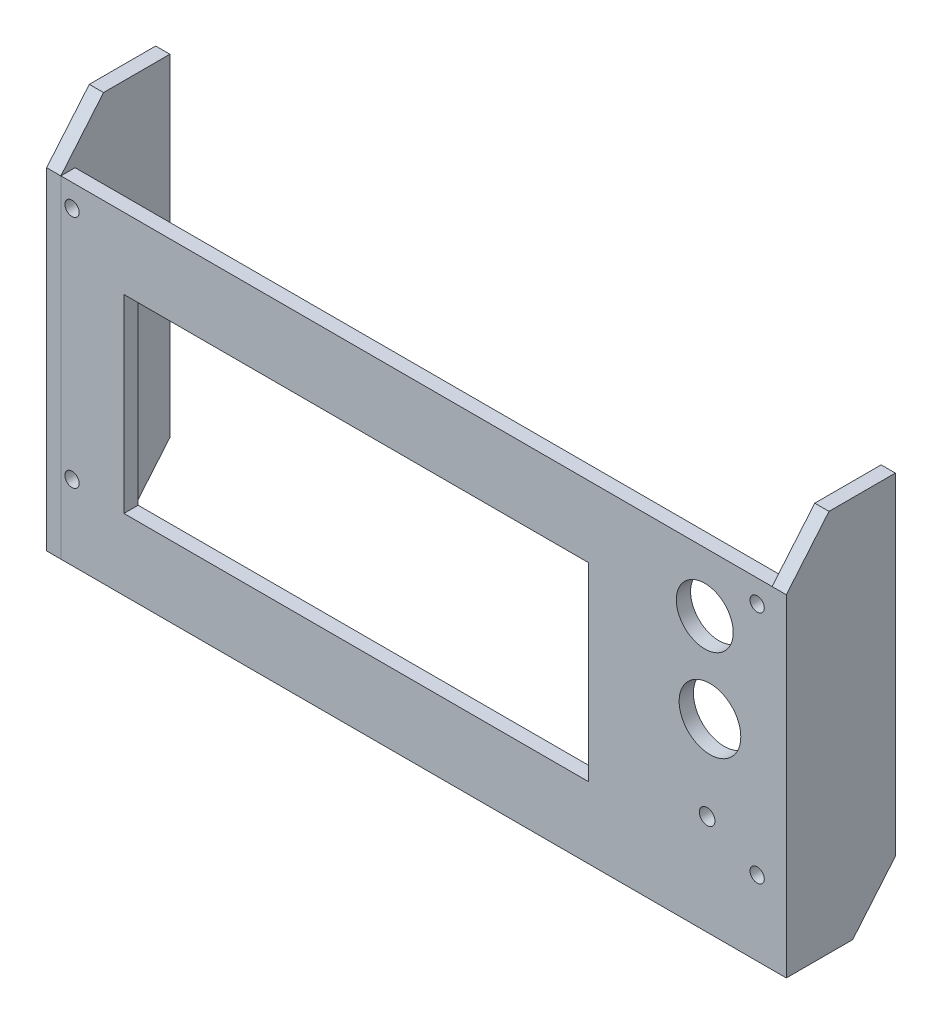
ISO-10303-21;
HEADER;
FILE_DESCRIPTION(('STEP AP214'),'2;1');
FILE_NAME('part.step','',(''),(''),'','','');
FILE_SCHEMA(('AUTOMOTIVE_DESIGN { 1 0 10303 214 1 1 1 1 }'));
ENDSEC;
DATA;
#1=APPLICATION_CONTEXT('core data for automotive mechanical design processes');
#2=APPLICATION_PROTOCOL_DEFINITION('international standard','automotive_design',2000,#1);
#3=PRODUCT_CONTEXT('',#1,'mechanical');
#4=PRODUCT('Part','Part','',(#3));
#5=PRODUCT_RELATED_PRODUCT_CATEGORY('part','',(#4));
#6=PRODUCT_DEFINITION_FORMATION('','',#4);
#7=PRODUCT_DEFINITION_CONTEXT('part definition',#1,'design');
#8=PRODUCT_DEFINITION('design','',#6,#7);
#9=PRODUCT_DEFINITION_SHAPE('','',#8);
#10=(LENGTH_UNIT() NAMED_UNIT(*) SI_UNIT(.MILLI.,.METRE.));
#11=(NAMED_UNIT(*) PLANE_ANGLE_UNIT() SI_UNIT($,.RADIAN.));
#12=(NAMED_UNIT(*) SI_UNIT($,.STERADIAN.) SOLID_ANGLE_UNIT());
#13=UNCERTAINTY_MEASURE_WITH_UNIT(LENGTH_MEASURE(1.E-05),#10,'distance_accuracy_value','');
#14=(GEOMETRIC_REPRESENTATION_CONTEXT(3) GLOBAL_UNCERTAINTY_ASSIGNED_CONTEXT((#13)) GLOBAL_UNIT_ASSIGNED_CONTEXT((#10,
#11,#12)) REPRESENTATION_CONTEXT('',''));
#15=CARTESIAN_POINT('',(0.,0.,0.));
#16=DIRECTION('',(0.,0.,1.));
#17=DIRECTION('',(1.,0.,0.));
#18=AXIS2_PLACEMENT_3D('',#15,#16,#17);
#19=CARTESIAN_POINT('',(-3.,0.,0.));
#20=DIRECTION('',(0.,-1.,0.));
#21=DIRECTION('',(0.,0.,-1.));
#22=AXIS2_PLACEMENT_3D('',#19,#20,#21);
#23=PLANE('',#22);
#24=DIRECTION('',(0.,0.,-1.));
#25=VECTOR('',#24,1.);
#26=CARTESIAN_POINT('',(0.,0.,0.));
#27=LINE('',#26,#25);
#28=CARTESIAN_POINT('',(0.,0.,3.));
#29=VERTEX_POINT('',#28);
#30=CARTESIAN_POINT('',(0.,0.,-11.));
#31=VERTEX_POINT('',#30);
#32=EDGE_CURVE('E125',#29,#31,#27,.T.);
#33=ORIENTED_EDGE('',*,*,#32,.F.);
#34=DIRECTION('',(1.,0.,0.));
#35=VECTOR('',#34,1.);
#36=CARTESIAN_POINT('',(-3.,0.,3.));
#37=LINE('',#36,#35);
#38=CARTESIAN_POINT('',(-3.,0.,3.));
#39=VERTEX_POINT('',#38);
#40=EDGE_CURVE('E12',#39,#29,#37,.T.);
#41=ORIENTED_EDGE('',*,*,#40,.F.);
#42=DIRECTION('',(0.,0.,-1.));
#43=VECTOR('',#42,1.);
#44=CARTESIAN_POINT('',(-3.,0.,0.));
#45=LINE('',#44,#43);
#46=CARTESIAN_POINT('',(-3.,0.,-11.));
#47=VERTEX_POINT('',#46);
#48=EDGE_CURVE('E139',#39,#47,#45,.T.);
#49=ORIENTED_EDGE('',*,*,#48,.T.);
#50=DIRECTION('',(1.,0.,0.));
#51=VECTOR('',#50,1.);
#52=CARTESIAN_POINT('',(-3.,0.,-11.));
#53=LINE('',#52,#51);
#54=EDGE_CURVE('E60',#47,#31,#53,.T.);
#55=ORIENTED_EDGE('',*,*,#54,.T.);
#56=EDGE_LOOP('',(#33,#41,#49,#55));
#57=FACE_BOUND('',#56,.T.);
#58=ADVANCED_FACE('F44',(#57),#23,.T.);
#59=CARTESIAN_POINT('',(-3.,0.,3.));
#60=DIRECTION('',(0.,0.,-1.));
#61=DIRECTION('',(-1.,0.,0.));
#62=AXIS2_PLACEMENT_3D('',#59,#60,#61);
#63=PLANE('',#62);
#64=DIRECTION('',(0.,1.,0.));
#65=VECTOR('',#64,1.);
#66=CARTESIAN_POINT('',(0.,0.,3.));
#67=LINE('',#66,#65);
#68=CARTESIAN_POINT('',(0.,70.,3.));
#69=VERTEX_POINT('',#68);
#70=EDGE_CURVE('E127',#29,#69,#67,.T.);
#71=ORIENTED_EDGE('',*,*,#70,.T.);
#72=DIRECTION('',(1.,0.,0.));
#73=VECTOR('',#72,1.);
#74=CARTESIAN_POINT('',(-3.,70.,3.));
#75=LINE('',#74,#73);
#76=CARTESIAN_POINT('',(-3.,70.,3.));
#77=VERTEX_POINT('',#76);
#78=EDGE_CURVE('E52',#77,#69,#75,.T.);
#79=ORIENTED_EDGE('',*,*,#78,.F.);
#80=DIRECTION('',(0.,1.,0.));
#81=VECTOR('',#80,1.);
#82=CARTESIAN_POINT('',(-3.,0.,3.));
#83=LINE('',#82,#81);
#84=EDGE_CURVE('E226',#39,#77,#83,.T.);
#85=ORIENTED_EDGE('',*,*,#84,.F.);
#86=ORIENTED_EDGE('',*,*,#40,.T.);
#87=EDGE_LOOP('',(#71,#79,#85,#86));
#88=FACE_BOUND('',#87,.T.);
#89=ADVANCED_FACE('F148',(#88),#63,.F.);
#90=CARTESIAN_POINT('',(-3.,30.3995254111756,36.2287436219277));
#91=DIRECTION('',(0.,0.642787609686538,0.766044443118979));
#92=DIRECTION('',(0.,-0.766044443118979,0.642787609686538));
#93=AXIS2_PLACEMENT_3D('',#90,#91,#92);
#94=PLANE('',#93);
#95=DIRECTION('',(0.,-0.76604444311898,0.642787609686538));
#96=VECTOR('',#95,1.);
#97=CARTESIAN_POINT('',(0.,30.3995254111756,36.2287436219277));
#98=LINE('',#97,#96);
#99=CARTESIAN_POINT('',(0.,80.7257823333479,-6.));
#100=VERTEX_POINT('',#99);
#101=EDGE_CURVE('E130',#100,#69,#98,.T.);
#102=ORIENTED_EDGE('',*,*,#101,.F.);
#103=DIRECTION('',(1.,0.,0.));
#104=VECTOR('',#103,1.);
#105=CARTESIAN_POINT('',(-3.,80.7257823333479,-6.));
#106=LINE('',#105,#104);
#107=CARTESIAN_POINT('',(-3.,80.7257823333479,-6.));
#108=VERTEX_POINT('',#107);
#109=EDGE_CURVE('E107',#108,#100,#106,.T.);
#110=ORIENTED_EDGE('',*,*,#109,.F.);
#111=DIRECTION('',(0.,-0.76604444311898,0.642787609686538));
#112=VECTOR('',#111,1.);
#113=CARTESIAN_POINT('',(-3.,30.3995254111756,36.2287436219277));
#114=LINE('',#113,#112);
#115=EDGE_CURVE('E117',#108,#77,#114,.T.);
#116=ORIENTED_EDGE('',*,*,#115,.T.);
#117=ORIENTED_EDGE('',*,*,#78,.T.);
#118=EDGE_LOOP('',(#102,#110,#116,#117));
#119=FACE_BOUND('',#118,.T.);
#120=ADVANCED_FACE('F145',(#119),#94,.T.);
#121=CARTESIAN_POINT('',(-3.,80.7257823333479,0.));
#122=DIRECTION('',(0.,1.,0.));
#123=DIRECTION('',(0.,0.,1.));
#124=AXIS2_PLACEMENT_3D('',#121,#122,#123);
#125=PLANE('',#124);
#126=DIRECTION('',(0.,0.,1.));
#127=VECTOR('',#126,1.);
#128=CARTESIAN_POINT('',(0.,80.7257823333479,0.));
#129=LINE('',#128,#127);
#130=CARTESIAN_POINT('',(0.,80.7257823333479,-20.));
#131=VERTEX_POINT('',#130);
#132=EDGE_CURVE('E103',#131,#100,#129,.T.);
#133=ORIENTED_EDGE('',*,*,#132,.F.);
#134=DIRECTION('',(1.,0.,0.));
#135=VECTOR('',#134,1.);
#136=CARTESIAN_POINT('',(-3.,80.7257823333479,-20.));
#137=LINE('',#136,#135);
#138=CARTESIAN_POINT('',(-3.,80.7257823333479,-20.));
#139=VERTEX_POINT('',#138);
#140=EDGE_CURVE('E98',#139,#131,#137,.T.);
#141=ORIENTED_EDGE('',*,*,#140,.F.);
#142=DIRECTION('',(0.,0.,1.));
#143=VECTOR('',#142,1.);
#144=CARTESIAN_POINT('',(-3.,80.7257823333479,0.));
#145=LINE('',#144,#143);
#146=EDGE_CURVE('E101',#139,#108,#145,.T.);
#147=ORIENTED_EDGE('',*,*,#146,.T.);
#148=ORIENTED_EDGE('',*,*,#109,.T.);
#149=EDGE_LOOP('',(#133,#141,#147,#148));
#150=FACE_BOUND('',#149,.T.);
#151=ADVANCED_FACE('F100',(#150),#125,.T.);
#152=CARTESIAN_POINT('',(-3.,0.,-20.));
#153=DIRECTION('',(0.,0.,-1.));
#154=DIRECTION('',(0.,1.,0.));
#155=AXIS2_PLACEMENT_3D('',#152,#153,#154);
#156=PLANE('',#155);
#157=DIRECTION('',(0.,1.,0.));
#158=VECTOR('',#157,1.);
#159=CARTESIAN_POINT('',(0.,0.,-20.));
#160=LINE('',#159,#158);
#161=CARTESIAN_POINT('',(0.,10.7257823333479,-20.));
#162=VERTEX_POINT('',#161);
#163=EDGE_CURVE('E134',#162,#131,#160,.T.);
#164=ORIENTED_EDGE('',*,*,#163,.F.);
#165=DIRECTION('',(1.,0.,0.));
#166=VECTOR('',#165,1.);
#167=CARTESIAN_POINT('',(-3.,10.7257823333479,-20.));
#168=LINE('',#167,#166);
#169=CARTESIAN_POINT('',(-3.,10.7257823333479,-20.));
#170=VERTEX_POINT('',#169);
#171=EDGE_CURVE('E79',#170,#162,#168,.T.);
#172=ORIENTED_EDGE('',*,*,#171,.F.);
#173=DIRECTION('',(0.,1.,0.));
#174=VECTOR('',#173,1.);
#175=CARTESIAN_POINT('',(-3.,0.,-20.));
#176=LINE('',#175,#174);
#177=EDGE_CURVE('E115',#170,#139,#176,.T.);
#178=ORIENTED_EDGE('',*,*,#177,.T.);
#179=ORIENTED_EDGE('',*,*,#140,.T.);
#180=EDGE_LOOP('',(#164,#172,#178,#179));
#181=FACE_BOUND('',#180,.T.);
#182=ADVANCED_FACE('F119',(#181),#156,.T.);
#183=CARTESIAN_POINT('',(-3.,-5.41644264156714,-6.45506497716814));
#184=DIRECTION('',(0.,-0.642787609686538,-0.76604444311898));
#185=DIRECTION('',(0.,0.76604444311898,-0.642787609686538));
#186=AXIS2_PLACEMENT_3D('',#183,#184,#185);
#187=PLANE('',#186);
#188=DIRECTION('',(0.,0.766044443118979,-0.642787609686538));
#189=VECTOR('',#188,1.);
#190=CARTESIAN_POINT('',(0.,-5.41644264156714,-6.45506497716814));
#191=LINE('',#190,#189);
#192=EDGE_CURVE('E136',#31,#162,#191,.T.);
#193=ORIENTED_EDGE('',*,*,#192,.F.);
#194=ORIENTED_EDGE('',*,*,#54,.F.);
#195=DIRECTION('',(0.,0.766044443118979,-0.642787609686538));
#196=VECTOR('',#195,1.);
#197=CARTESIAN_POINT('',(-3.,-5.41644264156714,-6.45506497716814));
#198=LINE('',#197,#196);
#199=EDGE_CURVE('E120',#47,#170,#198,.T.);
#200=ORIENTED_EDGE('',*,*,#199,.T.);
#201=ORIENTED_EDGE('',*,*,#171,.T.);
#202=EDGE_LOOP('',(#193,#194,#200,#201));
#203=FACE_BOUND('',#202,.T.);
#204=ADVANCED_FACE('F151',(#203),#187,.T.);
#205=CARTESIAN_POINT('',(-3.,0.,0.));
#206=DIRECTION('',(-1.,0.,0.));
#207=DIRECTION('',(0.,0.,1.));
#208=AXIS2_PLACEMENT_3D('',#205,#206,#207);
#209=PLANE('',#208);
#210=ORIENTED_EDGE('',*,*,#48,.F.);
#211=ORIENTED_EDGE('',*,*,#84,.T.);
#212=ORIENTED_EDGE('',*,*,#115,.F.);
#213=ORIENTED_EDGE('',*,*,#146,.F.);
#214=ORIENTED_EDGE('',*,*,#177,.F.);
#215=ORIENTED_EDGE('',*,*,#199,.F.);
#216=EDGE_LOOP('',(#210,#211,#212,#213,#214,#215));
#217=FACE_BOUND('',#216,.T.);
#218=ADVANCED_FACE('F113',(#217),#209,.T.);
#219=CARTESIAN_POINT('',(0.,0.,0.));
#220=DIRECTION('',(-1.,0.,0.));
#221=DIRECTION('',(0.,0.,1.));
#222=AXIS2_PLACEMENT_3D('',#219,#220,#221);
#223=PLANE('',#222);
#224=ORIENTED_EDGE('',*,*,#32,.T.);
#225=ORIENTED_EDGE('',*,*,#192,.T.);
#226=ORIENTED_EDGE('',*,*,#163,.T.);
#227=ORIENTED_EDGE('',*,*,#132,.T.);
#228=ORIENTED_EDGE('',*,*,#101,.T.);
#229=ORIENTED_EDGE('',*,*,#70,.F.);
#230=EDGE_LOOP('',(#224,#225,#226,#227,#228,#229));
#231=FACE_BOUND('',#230,.T.);
#232=ADVANCED_FACE('F150',(#231),#223,.F.);
#233=CLOSED_SHELL('',(#58,#89,#120,#151,#182,#204,#218,#232));
#234=MANIFOLD_SOLID_BREP('B2',#233);
#235=CARTESIAN_POINT('',(0.,0.,3.));
#236=DIRECTION('',(0.,0.,-1.));
#237=DIRECTION('',(-1.,0.,0.));
#238=AXIS2_PLACEMENT_3D('',#235,#236,#237);
#239=PLANE('',#238);
#240=CARTESIAN_POINT('',(146.85,15.75,3.));
#241=DIRECTION('',(0.,0.,1.));
#242=DIRECTION('',(1.,0.,0.));
#243=AXIS2_PLACEMENT_3D('',#240,#241,#242);
#244=CIRCLE('',#243,1.5);
#245=CARTESIAN_POINT('',(148.35,15.75,3.));
#246=VERTEX_POINT('',#245);
#247=EDGE_CURVE('E386',#246,#246,#244,.T.);
#248=ORIENTED_EDGE('',*,*,#247,.F.);
#249=EDGE_LOOP('',(#248));
#250=FACE_BOUND('',#249,.T.);
#251=CARTESIAN_POINT('',(2.35,15.75,3.));
#252=DIRECTION('',(0.,0.,1.));
#253=DIRECTION('',(1.,0.,0.));
#254=AXIS2_PLACEMENT_3D('',#251,#252,#253);
#255=CIRCLE('',#254,1.5);
#256=CARTESIAN_POINT('',(3.85000000000001,15.75,3.));
#257=VERTEX_POINT('',#256);
#258=EDGE_CURVE('E392',#257,#257,#255,.T.);
#259=ORIENTED_EDGE('',*,*,#258,.F.);
#260=EDGE_LOOP('',(#259));
#261=FACE_BOUND('',#260,.T.);
#262=CARTESIAN_POINT('',(2.35,65.25,3.));
#263=DIRECTION('',(0.,0.,1.));
#264=DIRECTION('',(1.,0.,0.));
#265=AXIS2_PLACEMENT_3D('',#262,#263,#264);
#266=CIRCLE('',#265,1.5);
#267=CARTESIAN_POINT('',(3.85000000000001,65.25,3.));
#268=VERTEX_POINT('',#267);
#269=EDGE_CURVE('E381',#268,#268,#266,.T.);
#270=ORIENTED_EDGE('',*,*,#269,.F.);
#271=EDGE_LOOP('',(#270));
#272=FACE_BOUND('',#271,.T.);
#273=CARTESIAN_POINT('',(146.85,65.25,3.));
#274=DIRECTION('',(0.,0.,1.));
#275=DIRECTION('',(1.,0.,0.));
#276=AXIS2_PLACEMENT_3D('',#273,#274,#275);
#277=CIRCLE('',#276,1.5);
#278=CARTESIAN_POINT('',(148.35,65.25,3.));
#279=VERTEX_POINT('',#278);
#280=EDGE_CURVE('E385',#279,#279,#277,.T.);
#281=ORIENTED_EDGE('',*,*,#280,.F.);
#282=EDGE_LOOP('',(#281));
#283=FACE_BOUND('',#282,.T.);
#284=CARTESIAN_POINT('',(136.3,21.15,3.));
#285=DIRECTION('',(0.,0.,1.));
#286=DIRECTION('',(1.,0.,0.));
#287=AXIS2_PLACEMENT_3D('',#284,#285,#286);
#288=CIRCLE('',#287,1.65000000000002);
#289=CARTESIAN_POINT('',(137.95,21.15,3.));
#290=VERTEX_POINT('',#289);
#291=EDGE_CURVE('E403',#290,#290,#288,.T.);
#292=ORIENTED_EDGE('',*,*,#291,.F.);
#293=EDGE_LOOP('',(#292));
#294=FACE_BOUND('',#293,.T.);
#295=CARTESIAN_POINT('',(136.9,39.25,3.));
#296=DIRECTION('',(0.,0.,1.));
#297=DIRECTION('',(1.,0.,0.));
#298=AXIS2_PLACEMENT_3D('',#295,#296,#297);
#299=CIRCLE('',#298,6.50000000000002);
#300=CARTESIAN_POINT('',(143.4,39.25,3.));
#301=VERTEX_POINT('',#300);
#302=EDGE_CURVE('E409',#301,#301,#299,.T.);
#303=ORIENTED_EDGE('',*,*,#302,.F.);
#304=EDGE_LOOP('',(#303));
#305=FACE_BOUND('',#304,.T.);
#306=DIRECTION('',(0.,1.,0.));
#307=VECTOR('',#306,1.);
#308=CARTESIAN_POINT('',(111.3,55.,3.));
#309=LINE('',#308,#307);
#310=CARTESIAN_POINT('',(111.3,15.,3.));
#311=VERTEX_POINT('',#310);
#312=CARTESIAN_POINT('',(111.3,55.,3.));
#313=VERTEX_POINT('',#312);
#314=EDGE_CURVE('E430',#311,#313,#309,.T.);
#315=ORIENTED_EDGE('',*,*,#314,.F.);
#316=DIRECTION('',(1.,0.,0.));
#317=VECTOR('',#316,1.);
#318=CARTESIAN_POINT('',(111.3,15.,3.));
#319=LINE('',#318,#317);
#320=CARTESIAN_POINT('',(13.3,15.,3.));
#321=VERTEX_POINT('',#320);
#322=EDGE_CURVE('E246',#321,#311,#319,.T.);
#323=ORIENTED_EDGE('',*,*,#322,.F.);
#324=DIRECTION('',(0.,-1.,0.));
#325=VECTOR('',#324,1.);
#326=CARTESIAN_POINT('',(13.3,15.,3.));
#327=LINE('',#326,#325);
#328=CARTESIAN_POINT('',(13.3,55.,3.));
#329=VERTEX_POINT('',#328);
#330=EDGE_CURVE('E421',#329,#321,#327,.T.);
#331=ORIENTED_EDGE('',*,*,#330,.F.);
#332=DIRECTION('',(-1.,0.,0.));
#333=VECTOR('',#332,1.);
#334=CARTESIAN_POINT('',(13.3,55.,3.));
#335=LINE('',#334,#333);
#336=EDGE_CURVE('E433',#313,#329,#335,.T.);
#337=ORIENTED_EDGE('',*,*,#336,.F.);
#338=EDGE_LOOP('',(#315,#323,#331,#337));
#339=FACE_BOUND('',#338,.T.);
#340=DIRECTION('',(1.,0.,0.));
#341=VECTOR('',#340,1.);
#342=CARTESIAN_POINT('',(150.,0.,3.));
#343=LINE('',#342,#341);
#344=CARTESIAN_POINT('',(0.,0.,3.));
#345=VERTEX_POINT('',#344);
#346=CARTESIAN_POINT('',(153.,0.,3.));
#347=VERTEX_POINT('',#346);
#348=EDGE_CURVE('E323',#345,#347,#343,.T.);
#349=ORIENTED_EDGE('',*,*,#348,.T.);
#350=DIRECTION('',(0.,-1.,0.));
#351=VECTOR('',#350,1.);
#352=CARTESIAN_POINT('',(153.,70.,3.));
#353=LINE('',#352,#351);
#354=CARTESIAN_POINT('',(153.,70.,3.));
#355=VERTEX_POINT('',#354);
#356=EDGE_CURVE('E328',#355,#347,#353,.T.);
#357=ORIENTED_EDGE('',*,*,#356,.F.);
#358=DIRECTION('',(-1.,0.,0.));
#359=VECTOR('',#358,1.);
#360=CARTESIAN_POINT('',(153.,70.,3.));
#361=LINE('',#360,#359);
#362=CARTESIAN_POINT('',(150.,70.,3.));
#363=VERTEX_POINT('',#362);
#364=EDGE_CURVE('E362',#355,#363,#361,.T.);
#365=ORIENTED_EDGE('',*,*,#364,.T.);
#366=DIRECTION('',(-1.,0.,0.));
#367=VECTOR('',#366,1.);
#368=CARTESIAN_POINT('',(0.,70.,3.));
#369=LINE('',#368,#367);
#370=CARTESIAN_POINT('',(0.,70.,3.));
#371=VERTEX_POINT('',#370);
#372=EDGE_CURVE('E334',#363,#371,#369,.T.);
#373=ORIENTED_EDGE('',*,*,#372,.T.);
#374=DIRECTION('',(0.,-1.,0.));
#375=VECTOR('',#374,1.);
#376=CARTESIAN_POINT('',(0.,0.,3.));
#377=LINE('',#376,#375);
#378=EDGE_CURVE('E330',#371,#345,#377,.T.);
#379=ORIENTED_EDGE('',*,*,#378,.T.);
#380=EDGE_LOOP('',(#349,#357,#365,#373,#379));
#381=FACE_BOUND('',#380,.T.);
#382=CARTESIAN_POINT('',(135.8,57.5,3.));
#383=DIRECTION('',(0.,0.,1.));
#384=DIRECTION('',(1.,0.,0.));
#385=AXIS2_PLACEMENT_3D('',#382,#383,#384);
#386=CIRCLE('',#385,6.00000000000002);
#387=CARTESIAN_POINT('',(141.8,57.5,3.));
#388=VERTEX_POINT('',#387);
#389=EDGE_CURVE('E446',#388,#388,#386,.T.);
#390=ORIENTED_EDGE('',*,*,#389,.F.);
#391=EDGE_LOOP('',(#390));
#392=FACE_BOUND('',#391,.T.);
#393=ADVANCED_FACE('F231',(#250,#261,#272,#283,#294,#305,#339,#381,#392),#239,.F.);
#394=CARTESIAN_POINT('',(0.,0.,0.));
#395=DIRECTION('',(0.,0.,-1.));
#396=DIRECTION('',(-1.,0.,0.));
#397=AXIS2_PLACEMENT_3D('',#394,#395,#396);
#398=PLANE('',#397);
#399=CARTESIAN_POINT('',(146.85,15.75,0.));
#400=DIRECTION('',(0.,0.,1.));
#401=DIRECTION('',(1.,0.,0.));
#402=AXIS2_PLACEMENT_3D('',#399,#400,#401);
#403=CIRCLE('',#402,1.5);
#404=CARTESIAN_POINT('',(148.35,15.75,0.));
#405=VERTEX_POINT('',#404);
#406=EDGE_CURVE('E382',#405,#405,#403,.T.);
#407=ORIENTED_EDGE('',*,*,#406,.T.);
#408=EDGE_LOOP('',(#407));
#409=FACE_BOUND('',#408,.T.);
#410=CARTESIAN_POINT('',(2.35,15.75,0.));
#411=DIRECTION('',(0.,0.,1.));
#412=DIRECTION('',(1.,0.,0.));
#413=AXIS2_PLACEMENT_3D('',#410,#411,#412);
#414=CIRCLE('',#413,1.5);
#415=CARTESIAN_POINT('',(3.85000000000001,15.75,0.));
#416=VERTEX_POINT('',#415);
#417=EDGE_CURVE('E389',#416,#416,#414,.T.);
#418=ORIENTED_EDGE('',*,*,#417,.T.);
#419=EDGE_LOOP('',(#418));
#420=FACE_BOUND('',#419,.T.);
#421=CARTESIAN_POINT('',(2.35,65.25,0.));
#422=DIRECTION('',(0.,0.,1.));
#423=DIRECTION('',(1.,0.,0.));
#424=AXIS2_PLACEMENT_3D('',#421,#422,#423);
#425=CIRCLE('',#424,1.5);
#426=CARTESIAN_POINT('',(3.85000000000001,65.25,0.));
#427=VERTEX_POINT('',#426);
#428=EDGE_CURVE('E395',#427,#427,#425,.T.);
#429=ORIENTED_EDGE('',*,*,#428,.T.);
#430=EDGE_LOOP('',(#429));
#431=FACE_BOUND('',#430,.T.);
#432=CARTESIAN_POINT('',(146.85,65.25,0.));
#433=DIRECTION('',(0.,0.,1.));
#434=DIRECTION('',(1.,0.,0.));
#435=AXIS2_PLACEMENT_3D('',#432,#433,#434);
#436=CIRCLE('',#435,1.5);
#437=CARTESIAN_POINT('',(148.35,65.25,0.));
#438=VERTEX_POINT('',#437);
#439=EDGE_CURVE('E400',#438,#438,#436,.T.);
#440=ORIENTED_EDGE('',*,*,#439,.T.);
#441=EDGE_LOOP('',(#440));
#442=FACE_BOUND('',#441,.T.);
#443=CARTESIAN_POINT('',(136.3,21.15,0.));
#444=DIRECTION('',(0.,0.,1.));
#445=DIRECTION('',(1.,0.,0.));
#446=AXIS2_PLACEMENT_3D('',#443,#444,#445);
#447=CIRCLE('',#446,1.65000000000002);
#448=CARTESIAN_POINT('',(137.95,21.15,0.));
#449=VERTEX_POINT('',#448);
#450=EDGE_CURVE('E406',#449,#449,#447,.T.);
#451=ORIENTED_EDGE('',*,*,#450,.T.);
#452=EDGE_LOOP('',(#451));
#453=FACE_BOUND('',#452,.T.);
#454=CARTESIAN_POINT('',(136.9,39.25,0.));
#455=DIRECTION('',(0.,0.,1.));
#456=DIRECTION('',(1.,0.,0.));
#457=AXIS2_PLACEMENT_3D('',#454,#455,#456);
#458=CIRCLE('',#457,6.50000000000002);
#459=CARTESIAN_POINT('',(143.4,39.25,0.));
#460=VERTEX_POINT('',#459);
#461=EDGE_CURVE('E412',#460,#460,#458,.T.);
#462=ORIENTED_EDGE('',*,*,#461,.T.);
#463=EDGE_LOOP('',(#462));
#464=FACE_BOUND('',#463,.T.);
#465=DIRECTION('',(1.,0.,0.));
#466=VECTOR('',#465,1.);
#467=CARTESIAN_POINT('',(111.3,15.,0.));
#468=LINE('',#467,#466);
#469=CARTESIAN_POINT('',(13.3,15.,0.));
#470=VERTEX_POINT('',#469);
#471=CARTESIAN_POINT('',(111.3,15.,0.));
#472=VERTEX_POINT('',#471);
#473=EDGE_CURVE('E417',#470,#472,#468,.T.);
#474=ORIENTED_EDGE('',*,*,#473,.T.);
#475=DIRECTION('',(0.,1.,0.));
#476=VECTOR('',#475,1.);
#477=CARTESIAN_POINT('',(111.3,55.,0.));
#478=LINE('',#477,#476);
#479=CARTESIAN_POINT('',(111.3,55.,0.));
#480=VERTEX_POINT('',#479);
#481=EDGE_CURVE('E420',#472,#480,#478,.T.);
#482=ORIENTED_EDGE('',*,*,#481,.T.);
#483=DIRECTION('',(-1.,0.,0.));
#484=VECTOR('',#483,1.);
#485=CARTESIAN_POINT('',(13.3,55.,0.));
#486=LINE('',#485,#484);
#487=CARTESIAN_POINT('',(13.3,55.,0.));
#488=VERTEX_POINT('',#487);
#489=EDGE_CURVE('E254',#480,#488,#486,.T.);
#490=ORIENTED_EDGE('',*,*,#489,.T.);
#491=DIRECTION('',(0.,-1.,0.));
#492=VECTOR('',#491,1.);
#493=CARTESIAN_POINT('',(13.3,15.,0.));
#494=LINE('',#493,#492);
#495=EDGE_CURVE('E425',#488,#470,#494,.T.);
#496=ORIENTED_EDGE('',*,*,#495,.T.);
#497=EDGE_LOOP('',(#474,#482,#490,#496));
#498=FACE_BOUND('',#497,.T.);
#499=DIRECTION('',(1.,0.,0.));
#500=VECTOR('',#499,1.);
#501=CARTESIAN_POINT('',(150.,0.,0.));
#502=LINE('',#501,#500);
#503=CARTESIAN_POINT('',(0.,0.,0.));
#504=VERTEX_POINT('',#503);
#505=CARTESIAN_POINT('',(150.,0.,0.));
#506=VERTEX_POINT('',#505);
#507=EDGE_CURVE('E449',#504,#506,#502,.T.);
#508=ORIENTED_EDGE('',*,*,#507,.F.);
#509=DIRECTION('',(0.,-1.,0.));
#510=VECTOR('',#509,1.);
#511=CARTESIAN_POINT('',(0.,0.,0.));
#512=LINE('',#511,#510);
#513=CARTESIAN_POINT('',(0.,70.,0.));
#514=VERTEX_POINT('',#513);
#515=EDGE_CURVE('E335',#514,#504,#512,.T.);
#516=ORIENTED_EDGE('',*,*,#515,.F.);
#517=DIRECTION('',(-1.,0.,0.));
#518=VECTOR('',#517,1.);
#519=CARTESIAN_POINT('',(0.,70.,0.));
#520=LINE('',#519,#518);
#521=CARTESIAN_POINT('',(150.,70.,0.));
#522=VERTEX_POINT('',#521);
#523=EDGE_CURVE('E458',#522,#514,#520,.T.);
#524=ORIENTED_EDGE('',*,*,#523,.F.);
#525=DIRECTION('',(0.,1.,0.));
#526=VECTOR('',#525,1.);
#527=CARTESIAN_POINT('',(150.,70.,0.));
#528=LINE('',#527,#526);
#529=EDGE_CURVE('E456',#506,#522,#528,.T.);
#530=ORIENTED_EDGE('',*,*,#529,.F.);
#531=EDGE_LOOP('',(#508,#516,#524,#530));
#532=FACE_BOUND('',#531,.T.);
#533=CARTESIAN_POINT('',(135.8,57.5,0.));
#534=DIRECTION('',(0.,0.,1.));
#535=DIRECTION('',(1.,0.,0.));
#536=AXIS2_PLACEMENT_3D('',#533,#534,#535);
#537=CIRCLE('',#536,6.00000000000002);
#538=CARTESIAN_POINT('',(141.8,57.5,0.));
#539=VERTEX_POINT('',#538);
#540=EDGE_CURVE('E440',#539,#539,#537,.T.);
#541=ORIENTED_EDGE('',*,*,#540,.T.);
#542=EDGE_LOOP('',(#541));
#543=FACE_BOUND('',#542,.T.);
#544=ADVANCED_FACE('F471',(#409,#420,#431,#442,#453,#464,#498,#532,#543),#398,.T.);
#545=CARTESIAN_POINT('',(150.,0.,3.));
#546=DIRECTION('',(0.,1.,0.));
#547=DIRECTION('',(-1.,0.,0.));
#548=AXIS2_PLACEMENT_3D('',#545,#546,#547);
#549=PLANE('',#548);
#550=ORIENTED_EDGE('',*,*,#507,.T.);
#551=DIRECTION('',(0.,0.,-1.));
#552=VECTOR('',#551,1.);
#553=CARTESIAN_POINT('',(150.,0.,-11.));
#554=LINE('',#553,#552);
#555=CARTESIAN_POINT('',(150.,0.,-11.));
#556=VERTEX_POINT('',#555);
#557=EDGE_CURVE('E363',#506,#556,#554,.T.);
#558=ORIENTED_EDGE('',*,*,#557,.T.);
#559=DIRECTION('',(-1.,0.,0.));
#560=VECTOR('',#559,1.);
#561=CARTESIAN_POINT('',(153.,0.,-11.));
#562=LINE('',#561,#560);
#563=CARTESIAN_POINT('',(153.,0.,-11.));
#564=VERTEX_POINT('',#563);
#565=EDGE_CURVE('E341',#564,#556,#562,.T.);
#566=ORIENTED_EDGE('',*,*,#565,.F.);
#567=DIRECTION('',(0.,0.,-1.));
#568=VECTOR('',#567,1.);
#569=CARTESIAN_POINT('',(153.,0.,-11.));
#570=LINE('',#569,#568);
#571=EDGE_CURVE('E338',#347,#564,#570,.T.);
#572=ORIENTED_EDGE('',*,*,#571,.F.);
#573=ORIENTED_EDGE('',*,*,#348,.F.);
#574=DIRECTION('',(0.,0.,-1.));
#575=VECTOR('',#574,1.);
#576=CARTESIAN_POINT('',(0.,0.,3.));
#577=LINE('',#576,#575);
#578=EDGE_CURVE('E454',#345,#504,#577,.T.);
#579=ORIENTED_EDGE('',*,*,#578,.T.);
#580=EDGE_LOOP('',(#550,#558,#566,#572,#573,#579));
#581=FACE_BOUND('',#580,.T.);
#582=ADVANCED_FACE('F233',(#581),#549,.F.);
#583=CARTESIAN_POINT('',(0.,70.,3.));
#584=DIRECTION('',(0.,-1.,0.));
#585=DIRECTION('',(0.,0.,-1.));
#586=AXIS2_PLACEMENT_3D('',#583,#584,#585);
#587=PLANE('',#586);
#588=ORIENTED_EDGE('',*,*,#523,.T.);
#589=DIRECTION('',(0.,0.,-1.));
#590=VECTOR('',#589,1.);
#591=CARTESIAN_POINT('',(0.,70.,3.));
#592=LINE('',#591,#590);
#593=EDGE_CURVE('E239',#371,#514,#592,.T.);
#594=ORIENTED_EDGE('',*,*,#593,.F.);
#595=ORIENTED_EDGE('',*,*,#372,.F.);
#596=DIRECTION('',(0.,0.,-1.));
#597=VECTOR('',#596,1.);
#598=CARTESIAN_POINT('',(150.,70.,3.));
#599=LINE('',#598,#597);
#600=EDGE_CURVE('E42',#363,#522,#599,.T.);
#601=ORIENTED_EDGE('',*,*,#600,.T.);
#602=EDGE_LOOP('',(#588,#594,#595,#601));
#603=FACE_BOUND('',#602,.T.);
#604=ADVANCED_FACE('F493',(#603),#587,.F.);
#605=CARTESIAN_POINT('',(0.,0.,3.));
#606=DIRECTION('',(1.,0.,0.));
#607=DIRECTION('',(0.,0.,-1.));
#608=AXIS2_PLACEMENT_3D('',#605,#606,#607);
#609=PLANE('',#608);
#610=ORIENTED_EDGE('',*,*,#515,.T.);
#611=ORIENTED_EDGE('',*,*,#578,.F.);
#612=ORIENTED_EDGE('',*,*,#378,.F.);
#613=ORIENTED_EDGE('',*,*,#593,.T.);
#614=EDGE_LOOP('',(#610,#611,#612,#613));
#615=FACE_BOUND('',#614,.T.);
#616=ADVANCED_FACE('F465',(#615),#609,.F.);
#617=CARTESIAN_POINT('',(135.8,57.5,3.));
#618=DIRECTION('',(0.,0.,-1.));
#619=DIRECTION('',(-1.,0.,0.));
#620=AXIS2_PLACEMENT_3D('',#617,#618,#619);
#621=CYLINDRICAL_SURFACE('',#620,6.00000000000002);
#622=ORIENTED_EDGE('',*,*,#389,.T.);
#623=EDGE_LOOP('',(#622));
#624=FACE_BOUND('',#623,.T.);
#625=ORIENTED_EDGE('',*,*,#540,.F.);
#626=EDGE_LOOP('',(#625));
#627=FACE_BOUND('',#626,.T.);
#628=ADVANCED_FACE('F499',(#624,#627),#621,.F.);
#629=CARTESIAN_POINT('',(111.3,15.,0.));
#630=DIRECTION('',(0.,-1.,0.));
#631=DIRECTION('',(1.,0.,0.));
#632=AXIS2_PLACEMENT_3D('',#629,#630,#631);
#633=PLANE('',#632);
#634=ORIENTED_EDGE('',*,*,#322,.T.);
#635=DIRECTION('',(0.,0.,1.));
#636=VECTOR('',#635,1.);
#637=CARTESIAN_POINT('',(111.3,15.,0.));
#638=LINE('',#637,#636);
#639=EDGE_CURVE('E428',#472,#311,#638,.T.);
#640=ORIENTED_EDGE('',*,*,#639,.F.);
#641=ORIENTED_EDGE('',*,*,#473,.F.);
#642=DIRECTION('',(0.,0.,1.));
#643=VECTOR('',#642,1.);
#644=CARTESIAN_POINT('',(13.3,15.,0.));
#645=LINE('',#644,#643);
#646=EDGE_CURVE('E438',#470,#321,#645,.T.);
#647=ORIENTED_EDGE('',*,*,#646,.T.);
#648=EDGE_LOOP('',(#634,#640,#641,#647));
#649=FACE_BOUND('',#648,.T.);
#650=ADVANCED_FACE('F514',(#649),#633,.F.);
#651=CARTESIAN_POINT('',(13.3,15.,0.));
#652=DIRECTION('',(-1.,0.,0.));
#653=DIRECTION('',(0.,-1.,0.));
#654=AXIS2_PLACEMENT_3D('',#651,#652,#653);
#655=PLANE('',#654);
#656=ORIENTED_EDGE('',*,*,#330,.T.);
#657=ORIENTED_EDGE('',*,*,#646,.F.);
#658=ORIENTED_EDGE('',*,*,#495,.F.);
#659=DIRECTION('',(0.,0.,1.));
#660=VECTOR('',#659,1.);
#661=CARTESIAN_POINT('',(13.3,55.,0.));
#662=LINE('',#661,#660);
#663=EDGE_CURVE('E441',#488,#329,#662,.T.);
#664=ORIENTED_EDGE('',*,*,#663,.T.);
#665=EDGE_LOOP('',(#656,#657,#658,#664));
#666=FACE_BOUND('',#665,.T.);
#667=ADVANCED_FACE('F518',(#666),#655,.F.);
#668=CARTESIAN_POINT('',(13.3,55.,0.));
#669=DIRECTION('',(0.,1.,0.));
#670=DIRECTION('',(0.,0.,1.));
#671=AXIS2_PLACEMENT_3D('',#668,#669,#670);
#672=PLANE('',#671);
#673=ORIENTED_EDGE('',*,*,#336,.T.);
#674=ORIENTED_EDGE('',*,*,#663,.F.);
#675=ORIENTED_EDGE('',*,*,#489,.F.);
#676=DIRECTION('',(0.,0.,1.));
#677=VECTOR('',#676,1.);
#678=CARTESIAN_POINT('',(111.3,55.,0.));
#679=LINE('',#678,#677);
#680=EDGE_CURVE('E443',#480,#313,#679,.T.);
#681=ORIENTED_EDGE('',*,*,#680,.T.);
#682=EDGE_LOOP('',(#673,#674,#675,#681));
#683=FACE_BOUND('',#682,.T.);
#684=ADVANCED_FACE('F523',(#683),#672,.F.);
#685=CARTESIAN_POINT('',(111.3,55.,0.));
#686=DIRECTION('',(1.,0.,0.));
#687=DIRECTION('',(0.,1.,0.));
#688=AXIS2_PLACEMENT_3D('',#685,#686,#687);
#689=PLANE('',#688);
#690=ORIENTED_EDGE('',*,*,#314,.T.);
#691=ORIENTED_EDGE('',*,*,#680,.F.);
#692=ORIENTED_EDGE('',*,*,#481,.F.);
#693=ORIENTED_EDGE('',*,*,#639,.T.);
#694=EDGE_LOOP('',(#690,#691,#692,#693));
#695=FACE_BOUND('',#694,.T.);
#696=ADVANCED_FACE('F519',(#695),#689,.F.);
#697=CARTESIAN_POINT('',(136.9,39.25,0.));
#698=DIRECTION('',(0.,0.,1.));
#699=DIRECTION('',(1.,0.,0.));
#700=AXIS2_PLACEMENT_3D('',#697,#698,#699);
#701=CYLINDRICAL_SURFACE('',#700,6.50000000000002);
#702=ORIENTED_EDGE('',*,*,#461,.F.);
#703=EDGE_LOOP('',(#702));
#704=FACE_BOUND('',#703,.T.);
#705=ORIENTED_EDGE('',*,*,#302,.T.);
#706=EDGE_LOOP('',(#705));
#707=FACE_BOUND('',#706,.T.);
#708=ADVANCED_FACE('F522',(#704,#707),#701,.F.);
#709=CARTESIAN_POINT('',(136.3,21.15,0.));
#710=DIRECTION('',(0.,0.,1.));
#711=DIRECTION('',(1.,0.,0.));
#712=AXIS2_PLACEMENT_3D('',#709,#710,#711);
#713=CYLINDRICAL_SURFACE('',#712,1.65000000000002);
#714=ORIENTED_EDGE('',*,*,#450,.F.);
#715=EDGE_LOOP('',(#714));
#716=FACE_BOUND('',#715,.T.);
#717=ORIENTED_EDGE('',*,*,#291,.T.);
#718=EDGE_LOOP('',(#717));
#719=FACE_BOUND('',#718,.T.);
#720=ADVANCED_FACE('F532',(#716,#719),#713,.F.);
#721=CARTESIAN_POINT('',(146.85,65.25,0.));
#722=DIRECTION('',(0.,0.,1.));
#723=DIRECTION('',(1.,0.,0.));
#724=AXIS2_PLACEMENT_3D('',#721,#722,#723);
#725=CYLINDRICAL_SURFACE('',#724,1.5);
#726=ORIENTED_EDGE('',*,*,#439,.F.);
#727=EDGE_LOOP('',(#726));
#728=FACE_BOUND('',#727,.T.);
#729=ORIENTED_EDGE('',*,*,#280,.T.);
#730=EDGE_LOOP('',(#729));
#731=FACE_BOUND('',#730,.T.);
#732=ADVANCED_FACE('F536',(#728,#731),#725,.F.);
#733=CARTESIAN_POINT('',(2.35,65.25,0.));
#734=DIRECTION('',(0.,0.,1.));
#735=DIRECTION('',(1.,0.,0.));
#736=AXIS2_PLACEMENT_3D('',#733,#734,#735);
#737=CYLINDRICAL_SURFACE('',#736,1.5);
#738=ORIENTED_EDGE('',*,*,#428,.F.);
#739=EDGE_LOOP('',(#738));
#740=FACE_BOUND('',#739,.T.);
#741=ORIENTED_EDGE('',*,*,#269,.T.);
#742=EDGE_LOOP('',(#741));
#743=FACE_BOUND('',#742,.T.);
#744=ADVANCED_FACE('F540',(#740,#743),#737,.F.);
#745=CARTESIAN_POINT('',(2.35,15.75,0.));
#746=DIRECTION('',(0.,0.,1.));
#747=DIRECTION('',(1.,0.,0.));
#748=AXIS2_PLACEMENT_3D('',#745,#746,#747);
#749=CYLINDRICAL_SURFACE('',#748,1.5);
#750=ORIENTED_EDGE('',*,*,#417,.F.);
#751=EDGE_LOOP('',(#750));
#752=FACE_BOUND('',#751,.T.);
#753=ORIENTED_EDGE('',*,*,#258,.T.);
#754=EDGE_LOOP('',(#753));
#755=FACE_BOUND('',#754,.T.);
#756=ADVANCED_FACE('F544',(#752,#755),#749,.F.);
#757=CARTESIAN_POINT('',(146.85,15.75,0.));
#758=DIRECTION('',(0.,0.,1.));
#759=DIRECTION('',(1.,0.,0.));
#760=AXIS2_PLACEMENT_3D('',#757,#758,#759);
#761=CYLINDRICAL_SURFACE('',#760,1.5);
#762=ORIENTED_EDGE('',*,*,#406,.F.);
#763=EDGE_LOOP('',(#762));
#764=FACE_BOUND('',#763,.T.);
#765=ORIENTED_EDGE('',*,*,#247,.T.);
#766=EDGE_LOOP('',(#765));
#767=FACE_BOUND('',#766,.T.);
#768=ADVANCED_FACE('F548',(#764,#767),#761,.F.);
#769=CARTESIAN_POINT('',(153.,10.7257823333479,-20.));
#770=DIRECTION('',(0.,0.642787609686538,0.76604444311898));
#771=DIRECTION('',(0.,-0.76604444311898,0.642787609686538));
#772=AXIS2_PLACEMENT_3D('',#769,#770,#771);
#773=PLANE('',#772);
#774=DIRECTION('',(0.,0.766044443118979,-0.642787609686538));
#775=VECTOR('',#774,1.);
#776=CARTESIAN_POINT('',(150.,10.7257823333479,-20.));
#777=LINE('',#776,#775);
#778=CARTESIAN_POINT('',(150.,10.7257823333479,-20.));
#779=VERTEX_POINT('',#778);
#780=EDGE_CURVE('E365',#556,#779,#777,.T.);
#781=ORIENTED_EDGE('',*,*,#780,.T.);
#782=DIRECTION('',(-1.,0.,0.));
#783=VECTOR('',#782,1.);
#784=CARTESIAN_POINT('',(153.,10.7257823333479,-20.));
#785=LINE('',#784,#783);
#786=CARTESIAN_POINT('',(153.,10.7257823333479,-20.));
#787=VERTEX_POINT('',#786);
#788=EDGE_CURVE('E377',#787,#779,#785,.T.);
#789=ORIENTED_EDGE('',*,*,#788,.F.);
#790=DIRECTION('',(0.,0.766044443118979,-0.642787609686538));
#791=VECTOR('',#790,1.);
#792=CARTESIAN_POINT('',(153.,10.7257823333479,-20.));
#793=LINE('',#792,#791);
#794=EDGE_CURVE('E344',#564,#787,#793,.T.);
#795=ORIENTED_EDGE('',*,*,#794,.F.);
#796=ORIENTED_EDGE('',*,*,#565,.T.);
#797=EDGE_LOOP('',(#781,#789,#795,#796));
#798=FACE_BOUND('',#797,.T.);
#799=ADVANCED_FACE('F477',(#798),#773,.F.);
#800=CARTESIAN_POINT('',(153.,80.7257823333479,-20.));
#801=DIRECTION('',(0.,0.,1.));
#802=DIRECTION('',(0.,-1.,0.));
#803=AXIS2_PLACEMENT_3D('',#800,#801,#802);
#804=PLANE('',#803);
#805=DIRECTION('',(0.,1.,0.));
#806=VECTOR('',#805,1.);
#807=CARTESIAN_POINT('',(150.,80.7257823333479,-20.));
#808=LINE('',#807,#806);
#809=CARTESIAN_POINT('',(150.,80.7257823333479,-20.));
#810=VERTEX_POINT('',#809);
#811=EDGE_CURVE('E367',#779,#810,#808,.T.);
#812=ORIENTED_EDGE('',*,*,#811,.T.);
#813=DIRECTION('',(-1.,0.,0.));
#814=VECTOR('',#813,1.);
#815=CARTESIAN_POINT('',(153.,80.7257823333479,-20.));
#816=LINE('',#815,#814);
#817=CARTESIAN_POINT('',(153.,80.7257823333479,-20.));
#818=VERTEX_POINT('',#817);
#819=EDGE_CURVE('E374',#818,#810,#816,.T.);
#820=ORIENTED_EDGE('',*,*,#819,.F.);
#821=DIRECTION('',(0.,1.,0.));
#822=VECTOR('',#821,1.);
#823=CARTESIAN_POINT('',(153.,80.7257823333479,-20.));
#824=LINE('',#823,#822);
#825=EDGE_CURVE('E357',#787,#818,#824,.T.);
#826=ORIENTED_EDGE('',*,*,#825,.F.);
#827=ORIENTED_EDGE('',*,*,#788,.T.);
#828=EDGE_LOOP('',(#812,#820,#826,#827));
#829=FACE_BOUND('',#828,.T.);
#830=ADVANCED_FACE('F485',(#829),#804,.F.);
#831=CARTESIAN_POINT('',(153.,80.7257823333479,-5.99999999999999));
#832=DIRECTION('',(0.,-1.,0.));
#833=DIRECTION('',(0.,0.,-1.));
#834=AXIS2_PLACEMENT_3D('',#831,#832,#833);
#835=PLANE('',#834);
#836=DIRECTION('',(0.,0.,1.));
#837=VECTOR('',#836,1.);
#838=CARTESIAN_POINT('',(150.,80.7257823333479,-5.99999999999999));
#839=LINE('',#838,#837);
#840=CARTESIAN_POINT('',(150.,80.7257823333479,-5.99999999999999));
#841=VERTEX_POINT('',#840);
#842=EDGE_CURVE('E353',#810,#841,#839,.T.);
#843=ORIENTED_EDGE('',*,*,#842,.T.);
#844=DIRECTION('',(-1.,0.,0.));
#845=VECTOR('',#844,1.);
#846=CARTESIAN_POINT('',(153.,80.7257823333479,-5.99999999999999));
#847=LINE('',#846,#845);
#848=CARTESIAN_POINT('',(153.,80.7257823333479,-5.99999999999999));
#849=VERTEX_POINT('',#848);
#850=EDGE_CURVE('E371',#849,#841,#847,.T.);
#851=ORIENTED_EDGE('',*,*,#850,.F.);
#852=DIRECTION('',(0.,0.,1.));
#853=VECTOR('',#852,1.);
#854=CARTESIAN_POINT('',(153.,80.7257823333479,-5.99999999999999));
#855=LINE('',#854,#853);
#856=EDGE_CURVE('E359',#818,#849,#855,.T.);
#857=ORIENTED_EDGE('',*,*,#856,.F.);
#858=ORIENTED_EDGE('',*,*,#819,.T.);
#859=EDGE_LOOP('',(#843,#851,#857,#858));
#860=FACE_BOUND('',#859,.T.);
#861=ADVANCED_FACE('F489',(#860),#835,.F.);
#862=CARTESIAN_POINT('',(153.,70.,3.));
#863=DIRECTION('',(0.,-0.642787609686538,-0.766044443118979));
#864=DIRECTION('',(0.,0.766044443118979,-0.642787609686538));
#865=AXIS2_PLACEMENT_3D('',#862,#863,#864);
#866=PLANE('',#865);
#867=DIRECTION('',(0.,-0.766044443118979,0.642787609686538));
#868=VECTOR('',#867,1.);
#869=CARTESIAN_POINT('',(150.,70.,3.));
#870=LINE('',#869,#868);
#871=EDGE_CURVE('E350',#841,#363,#870,.T.);
#872=ORIENTED_EDGE('',*,*,#871,.T.);
#873=ORIENTED_EDGE('',*,*,#364,.F.);
#874=DIRECTION('',(0.,-0.766044443118979,0.642787609686538));
#875=VECTOR('',#874,1.);
#876=CARTESIAN_POINT('',(153.,70.,3.));
#877=LINE('',#876,#875);
#878=EDGE_CURVE('E348',#849,#355,#877,.T.);
#879=ORIENTED_EDGE('',*,*,#878,.F.);
#880=ORIENTED_EDGE('',*,*,#850,.T.);
#881=EDGE_LOOP('',(#872,#873,#879,#880));
#882=FACE_BOUND('',#881,.T.);
#883=ADVANCED_FACE('F492',(#882),#866,.F.);
#884=CARTESIAN_POINT('',(153.,0.,0.));
#885=DIRECTION('',(-1.,0.,0.));
#886=DIRECTION('',(0.,0.,1.));
#887=AXIS2_PLACEMENT_3D('',#884,#885,#886);
#888=PLANE('',#887);
#889=ORIENTED_EDGE('',*,*,#356,.T.);
#890=ORIENTED_EDGE('',*,*,#571,.T.);
#891=ORIENTED_EDGE('',*,*,#794,.T.);
#892=ORIENTED_EDGE('',*,*,#825,.T.);
#893=ORIENTED_EDGE('',*,*,#856,.T.);
#894=ORIENTED_EDGE('',*,*,#878,.T.);
#895=EDGE_LOOP('',(#889,#890,#891,#892,#893,#894));
#896=FACE_BOUND('',#895,.T.);
#897=ADVANCED_FACE('F346',(#896),#888,.F.);
#898=CARTESIAN_POINT('',(150.,0.,0.));
#899=DIRECTION('',(-1.,0.,0.));
#900=DIRECTION('',(0.,0.,1.));
#901=AXIS2_PLACEMENT_3D('',#898,#899,#900);
#902=PLANE('',#901);
#903=ORIENTED_EDGE('',*,*,#557,.F.);
#904=ORIENTED_EDGE('',*,*,#529,.T.);
#905=ORIENTED_EDGE('',*,*,#600,.F.);
#906=ORIENTED_EDGE('',*,*,#871,.F.);
#907=ORIENTED_EDGE('',*,*,#842,.F.);
#908=ORIENTED_EDGE('',*,*,#811,.F.);
#909=ORIENTED_EDGE('',*,*,#780,.F.);
#910=EDGE_LOOP('',(#903,#904,#905,#906,#907,#908,#909));
#911=FACE_BOUND('',#910,.T.);
#912=ADVANCED_FACE('F480',(#911),#902,.T.);
#913=CLOSED_SHELL('',(#393,#544,#582,#604,#616,#628,#650,#667,#684,#696,#708,#720,#732,#744,
#756,#768,#799,#830,#861,#883,#897,#912));
#914=MANIFOLD_SOLID_BREP('B6',#913);
#915=ADVANCED_BREP_SHAPE_REPRESENTATION('',(#18,#234,#914),#14);
#916=SHAPE_DEFINITION_REPRESENTATION(#9,#915);
ENDSEC;
END-ISO-10303-21;
